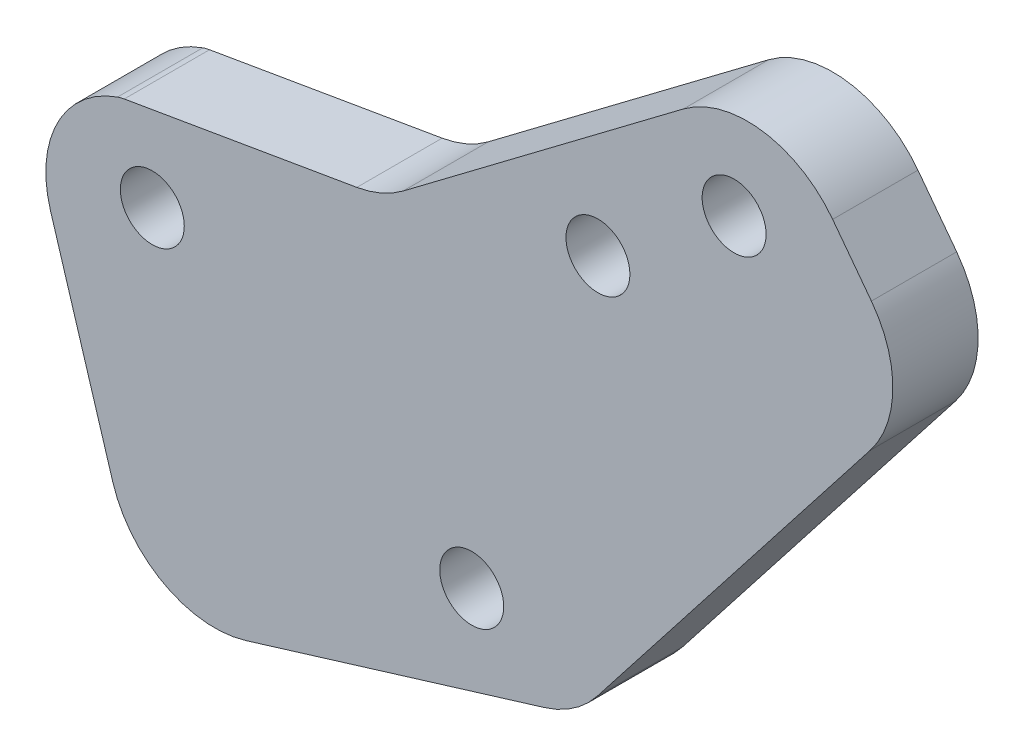
ISO-10303-21;
HEADER;
FILE_DESCRIPTION(('STEP AP214'),'2;1');
FILE_NAME('part.step','',(''),(''),'','','');
FILE_SCHEMA(('AUTOMOTIVE_DESIGN { 1 0 10303 214 1 1 1 1 }'));
ENDSEC;
DATA;
#1=APPLICATION_CONTEXT('core data for automotive mechanical design processes');
#2=APPLICATION_PROTOCOL_DEFINITION('international standard','automotive_design',2000,#1);
#3=PRODUCT_CONTEXT('',#1,'mechanical');
#4=PRODUCT('Part','Part','',(#3));
#5=PRODUCT_RELATED_PRODUCT_CATEGORY('part','',(#4));
#6=PRODUCT_DEFINITION_FORMATION('','',#4);
#7=PRODUCT_DEFINITION_CONTEXT('part definition',#1,'design');
#8=PRODUCT_DEFINITION('design','',#6,#7);
#9=PRODUCT_DEFINITION_SHAPE('','',#8);
#10=(LENGTH_UNIT() NAMED_UNIT(*) SI_UNIT(.MILLI.,.METRE.));
#11=(NAMED_UNIT(*) PLANE_ANGLE_UNIT() SI_UNIT($,.RADIAN.));
#12=(NAMED_UNIT(*) SI_UNIT($,.STERADIAN.) SOLID_ANGLE_UNIT());
#13=UNCERTAINTY_MEASURE_WITH_UNIT(LENGTH_MEASURE(1.E-05),#10,'distance_accuracy_value','');
#14=(GEOMETRIC_REPRESENTATION_CONTEXT(3) GLOBAL_UNCERTAINTY_ASSIGNED_CONTEXT((#13)) GLOBAL_UNIT_ASSIGNED_CONTEXT((#10,
#11,#12)) REPRESENTATION_CONTEXT('',''));
#15=CARTESIAN_POINT('',(0.,0.,0.));
#16=DIRECTION('',(0.,0.,1.));
#17=DIRECTION('',(1.,0.,0.));
#18=AXIS2_PLACEMENT_3D('',#15,#16,#17);
#19=CARTESIAN_POINT('',(-13.3090812894519,-11.9425105504531,4.));
#20=DIRECTION('',(0.,0.,1.));
#21=DIRECTION('',(1.,0.,0.));
#22=AXIS2_PLACEMENT_3D('',#19,#20,#21);
#23=PLANE('',#22);
#24=DIRECTION('',(-0.985725884798114,-0.168358189699742,0.));
#25=VECTOR('',#24,1.);
#26=CARTESIAN_POINT('',(-5.44500347129782,4.49425447166441,4.));
#27=LINE('',#26,#25);
#28=CARTESIAN_POINT('',(-6.64226547749985,4.2897667260659,4.));
#29=VERTEX_POINT('',#28);
#30=CARTESIAN_POINT('',(-17.5526898775014,2.42630820360216,4.));
#31=VERTEX_POINT('',#30);
#32=EDGE_CURVE('E222',#29,#31,#27,.T.);
#33=ORIENTED_EDGE('',*,*,#32,.T.);
#34=CARTESIAN_POINT('',(-17.2159734981019,0.454856434005934,4.));
#35=DIRECTION('',(0.,0.,1.));
#36=DIRECTION('',(1.,0.,0.));
#37=AXIS2_PLACEMENT_3D('',#34,#35,#36);
#38=CIRCLE('',#37,2.);
#39=CARTESIAN_POINT('',(-17.8714236057181,2.34440271722472,4.));
#40=VERTEX_POINT('',#39);
#41=EDGE_CURVE('E11',#31,#40,#38,.T.);
#42=ORIENTED_EDGE('',*,*,#41,.T.);
#43=CARTESIAN_POINT('',(-16.2327983366776,-2.37946299082225,4.));
#44=DIRECTION('',(0.,0.,1.));
#45=DIRECTION('',(1.,0.,0.));
#46=AXIS2_PLACEMENT_3D('',#43,#44,#45);
#47=CIRCLE('',#46,5.);
#48=CARTESIAN_POINT('',(-21.0143221164931,-3.84132151443514,4.));
#49=VERTEX_POINT('',#48);
#50=EDGE_CURVE('E209',#40,#49,#47,.T.);
#51=ORIENTED_EDGE('',*,*,#50,.T.);
#52=DIRECTION('',(0.292371704722578,-0.956304755963084,0.));
#53=VECTOR('',#52,1.);
#54=CARTESIAN_POINT('',(-21.0143221164931,-3.84132151443514,4.));
#55=LINE('',#54,#53);
#56=CARTESIAN_POINT('',(-18.0906050692673,-13.404369074066,4.));
#57=VERTEX_POINT('',#56);
#58=EDGE_CURVE('E147',#49,#57,#55,.T.);
#59=ORIENTED_EDGE('',*,*,#58,.T.);
#60=CARTESIAN_POINT('',(-13.3090812894519,-11.9425105504531,4.));
#61=DIRECTION('',(0.,0.,1.));
#62=DIRECTION('',(1.,0.,0.));
#63=AXIS2_PLACEMENT_3D('',#60,#61,#62);
#64=CIRCLE('',#63,5.);
#65=CARTESIAN_POINT('',(-11.847222765839,-16.7240343302685,4.));
#66=VERTEX_POINT('',#65);
#67=EDGE_CURVE('E142',#57,#66,#64,.T.);
#68=ORIENTED_EDGE('',*,*,#67,.T.);
#69=DIRECTION('',(0.956304755963084,0.292371704722577,0.));
#70=VECTOR('',#69,1.);
#71=CARTESIAN_POINT('',(-11.847222765839,-16.7240343302685,4.));
#72=LINE('',#71,#70);
#73=CARTESIAN_POINT('',(2.15671770663999,-12.4426000665136,4.));
#74=VERTEX_POINT('',#73);
#75=EDGE_CURVE('E130',#66,#74,#72,.T.);
#76=ORIENTED_EDGE('',*,*,#75,.T.);
#77=CARTESIAN_POINT('',(0.694859183027105,-7.66107628669814,4.));
#78=DIRECTION('',(0.,0.,1.));
#79=DIRECTION('',(1.,0.,0.));
#80=AXIS2_PLACEMENT_3D('',#77,#78,#79);
#81=CIRCLE('',#80,5.);
#82=CARTESIAN_POINT('',(4.6349129510602,-10.7393836633271,4.));
#83=VERTEX_POINT('',#82);
#84=EDGE_CURVE('E195',#74,#83,#81,.T.);
#85=ORIENTED_EDGE('',*,*,#84,.T.);
#86=DIRECTION('',(0.615661475325789,0.78801075360662,0.));
#87=VECTOR('',#86,1.);
#88=CARTESIAN_POINT('',(19.8025777587109,8.67434198712827,4.));
#89=LINE('',#88,#87);
#90=CARTESIAN_POINT('',(17.4405094313288,5.65103239682827,4.));
#91=VERTEX_POINT('',#90);
#92=EDGE_CURVE('E269',#83,#91,#89,.T.);
#93=ORIENTED_EDGE('',*,*,#92,.T.);
#94=CARTESIAN_POINT('',(13.5004556632957,8.72933977345722,4.));
#95=DIRECTION('',(0.,0.,1.));
#96=DIRECTION('',(1.,0.,0.));
#97=AXIS2_PLACEMENT_3D('',#94,#95,#96);
#98=CIRCLE('',#97,5.);
#99=CARTESIAN_POINT('',(17.4936332135327,11.7384148892168,4.));
#100=VERTEX_POINT('',#99);
#101=EDGE_CURVE('E197',#91,#100,#98,.T.);
#102=ORIENTED_EDGE('',*,*,#101,.T.);
#103=DIRECTION('',(-0.601815023151916,0.798635510047392,0.));
#104=VECTOR('',#103,1.);
#105=CARTESIAN_POINT('',(12.6674544163603,18.1429704702208,4.));
#106=LINE('',#105,#104);
#107=CARTESIAN_POINT('',(15.6765295321199,14.1497929199838,4.));
#108=VERTEX_POINT('',#107);
#109=EDGE_CURVE('E141',#100,#108,#106,.T.);
#110=ORIENTED_EDGE('',*,*,#109,.T.);
#111=CARTESIAN_POINT('',(11.6833519818829,11.1407178042243,4.));
#112=DIRECTION('',(0.,0.,1.));
#113=DIRECTION('',(1.,0.,0.));
#114=AXIS2_PLACEMENT_3D('',#111,#112,#113);
#115=CIRCLE('',#114,5.);
#116=CARTESIAN_POINT('',(8.67427686612335,15.1338953544612,4.));
#117=VERTEX_POINT('',#116);
#118=EDGE_CURVE('E174',#108,#117,#115,.T.);
#119=ORIENTED_EDGE('',*,*,#118,.T.);
#120=DIRECTION('',(-0.798635510047392,-0.601815023151916,0.));
#121=VECTOR('',#120,1.);
#122=CARTESIAN_POINT('',(12.6674544163603,18.1429704702208,4.));
#123=LINE('',#122,#121);
#124=CARTESIAN_POINT('',(-4.47498131023898,5.22521859981951,4.));
#125=VERTEX_POINT('',#124);
#126=EDGE_CURVE('E243',#117,#125,#123,.T.);
#127=ORIENTED_EDGE('',*,*,#126,.T.);
#128=CARTESIAN_POINT('',(-7.48405642599856,9.21839615005648,4.));
#129=DIRECTION('',(0.,0.,1.));
#130=DIRECTION('',(1.,0.,0.));
#131=AXIS2_PLACEMENT_3D('',#128,#129,#130);
#132=CIRCLE('',#131,5.);
#133=EDGE_CURVE('E181',#125,#29,#132,.F.);
#134=ORIENTED_EDGE('',*,*,#133,.T.);
#135=EDGE_LOOP('',(#33,#42,#51,#59,#68,#76,#85,#93,#102,#110,#119,#127,#134));
#136=FACE_BOUND('',#135,.T.);
#137=CARTESIAN_POINT('',(-16.2382786146113,-1.33544672344239,4.));
#138=DIRECTION('',(0.,0.,1.));
#139=DIRECTION('',(1.,0.,0.));
#140=AXIS2_PLACEMENT_3D('',#137,#138,#139);
#141=CIRCLE('',#140,1.5);
#142=CARTESIAN_POINT('',(-14.7382786146113,-1.33544672344239,4.));
#143=VERTEX_POINT('',#142);
#144=EDGE_CURVE('E257',#143,#143,#141,.T.);
#145=ORIENTED_EDGE('',*,*,#144,.F.);
#146=EDGE_LOOP('',(#145));
#147=FACE_BOUND('',#146,.T.);
#148=CARTESIAN_POINT('',(11.0540255403552,11.9758621995627,4.));
#149=DIRECTION('',(0.,0.,1.));
#150=DIRECTION('',(1.,0.,0.));
#151=AXIS2_PLACEMENT_3D('',#148,#149,#150);
#152=CIRCLE('',#151,1.5);
#153=CARTESIAN_POINT('',(12.5540255403552,11.9758621995627,4.));
#154=VERTEX_POINT('',#153);
#155=EDGE_CURVE('E228',#154,#154,#152,.T.);
#156=ORIENTED_EDGE('',*,*,#155,.F.);
#157=EDGE_LOOP('',(#156));
#158=FACE_BOUND('',#157,.T.);
#159=CARTESIAN_POINT('',(4.6649414599761,7.16134201434734,4.));
#160=DIRECTION('',(0.,0.,1.));
#161=DIRECTION('',(1.,0.,0.));
#162=AXIS2_PLACEMENT_3D('',#159,#160,#161);
#163=CIRCLE('',#162,1.5);
#164=CARTESIAN_POINT('',(6.16494145997611,7.16134201434734,4.));
#165=VERTEX_POINT('',#164);
#166=EDGE_CURVE('E251',#165,#165,#163,.T.);
#167=ORIENTED_EDGE('',*,*,#166,.F.);
#168=EDGE_LOOP('',(#167));
#169=FACE_BOUND('',#168,.T.);
#170=CARTESIAN_POINT('',(-1.25416108638335,-9.30264333832848,4.));
#171=DIRECTION('',(0.,0.,1.));
#172=DIRECTION('',(1.,0.,0.));
#173=AXIS2_PLACEMENT_3D('',#170,#171,#172);
#174=CIRCLE('',#173,1.50000000000001);
#175=CARTESIAN_POINT('',(0.245838913616663,-9.30264333832848,4.));
#176=VERTEX_POINT('',#175);
#177=EDGE_CURVE('E263',#176,#176,#174,.T.);
#178=ORIENTED_EDGE('',*,*,#177,.F.);
#179=EDGE_LOOP('',(#178));
#180=FACE_BOUND('',#179,.T.);
#181=ADVANCED_FACE('F35',(#136,#147,#158,#169,#180),#23,.T.);
#182=CARTESIAN_POINT('',(-13.3090812894519,-11.9425105504531,0.));
#183=DIRECTION('',(0.,0.,1.));
#184=DIRECTION('',(1.,0.,0.));
#185=AXIS2_PLACEMENT_3D('',#182,#183,#184);
#186=PLANE('',#185);
#187=CARTESIAN_POINT('',(-16.2327983366776,-2.37946299082225,0.));
#188=DIRECTION('',(0.,0.,1.));
#189=DIRECTION('',(1.,0.,0.));
#190=AXIS2_PLACEMENT_3D('',#187,#188,#189);
#191=CIRCLE('',#190,5.);
#192=CARTESIAN_POINT('',(-17.8714236057181,2.34440271722472,0.));
#193=VERTEX_POINT('',#192);
#194=CARTESIAN_POINT('',(-21.0143221164931,-3.84132151443514,0.));
#195=VERTEX_POINT('',#194);
#196=EDGE_CURVE('E208',#193,#195,#191,.T.);
#197=ORIENTED_EDGE('',*,*,#196,.F.);
#198=CARTESIAN_POINT('',(-17.2159734981019,0.454856434005934,0.));
#199=DIRECTION('',(0.,0.,1.));
#200=DIRECTION('',(1.,0.,0.));
#201=AXIS2_PLACEMENT_3D('',#198,#199,#200);
#202=CIRCLE('',#201,2.);
#203=CARTESIAN_POINT('',(-17.5526898775014,2.42630820360216,0.));
#204=VERTEX_POINT('',#203);
#205=EDGE_CURVE('E57',#193,#204,#202,.F.);
#206=ORIENTED_EDGE('',*,*,#205,.T.);
#207=DIRECTION('',(-0.985725884798114,-0.168358189699742,0.));
#208=VECTOR('',#207,1.);
#209=CARTESIAN_POINT('',(-5.44500347129782,4.49425447166441,0.));
#210=LINE('',#209,#208);
#211=CARTESIAN_POINT('',(-6.64226547749985,4.2897667260659,0.));
#212=VERTEX_POINT('',#211);
#213=EDGE_CURVE('E215',#212,#204,#210,.T.);
#214=ORIENTED_EDGE('',*,*,#213,.F.);
#215=CARTESIAN_POINT('',(-7.48405642599856,9.21839615005648,0.));
#216=DIRECTION('',(0.,0.,1.));
#217=DIRECTION('',(1.,0.,0.));
#218=AXIS2_PLACEMENT_3D('',#215,#216,#217);
#219=CIRCLE('',#218,5.);
#220=CARTESIAN_POINT('',(-4.47498131023898,5.22521859981951,0.));
#221=VERTEX_POINT('',#220);
#222=EDGE_CURVE('E179',#212,#221,#219,.T.);
#223=ORIENTED_EDGE('',*,*,#222,.T.);
#224=DIRECTION('',(-0.798635510047392,-0.601815023151916,0.));
#225=VECTOR('',#224,1.);
#226=CARTESIAN_POINT('',(12.6674544163603,18.1429704702208,0.));
#227=LINE('',#226,#225);
#228=CARTESIAN_POINT('',(8.67427686612335,15.1338953544612,0.));
#229=VERTEX_POINT('',#228);
#230=EDGE_CURVE('E218',#229,#221,#227,.T.);
#231=ORIENTED_EDGE('',*,*,#230,.F.);
#232=CARTESIAN_POINT('',(11.6833519818829,11.1407178042243,0.));
#233=DIRECTION('',(0.,0.,1.));
#234=DIRECTION('',(1.,0.,0.));
#235=AXIS2_PLACEMENT_3D('',#232,#233,#234);
#236=CIRCLE('',#235,5.);
#237=CARTESIAN_POINT('',(15.6765295321199,14.1497929199838,0.));
#238=VERTEX_POINT('',#237);
#239=EDGE_CURVE('E168',#229,#238,#236,.F.);
#240=ORIENTED_EDGE('',*,*,#239,.T.);
#241=DIRECTION('',(-0.601815023151916,0.798635510047392,0.));
#242=VECTOR('',#241,1.);
#243=CARTESIAN_POINT('',(12.6674544163603,18.1429704702208,0.));
#244=LINE('',#243,#242);
#245=CARTESIAN_POINT('',(17.4936332135327,11.7384148892168,0.));
#246=VERTEX_POINT('',#245);
#247=EDGE_CURVE('E230',#246,#238,#244,.T.);
#248=ORIENTED_EDGE('',*,*,#247,.F.);
#249=CARTESIAN_POINT('',(13.5004556632957,8.72933977345722,0.));
#250=DIRECTION('',(0.,0.,1.));
#251=DIRECTION('',(1.,0.,0.));
#252=AXIS2_PLACEMENT_3D('',#249,#250,#251);
#253=CIRCLE('',#252,5.);
#254=CARTESIAN_POINT('',(17.4405094313288,5.65103239682827,0.));
#255=VERTEX_POINT('',#254);
#256=EDGE_CURVE('E188',#246,#255,#253,.F.);
#257=ORIENTED_EDGE('',*,*,#256,.T.);
#258=DIRECTION('',(0.615661475325789,0.78801075360662,0.));
#259=VECTOR('',#258,1.);
#260=CARTESIAN_POINT('',(19.8025777587109,8.67434198712827,0.));
#261=LINE('',#260,#259);
#262=CARTESIAN_POINT('',(4.6349129510602,-10.7393836633271,0.));
#263=VERTEX_POINT('',#262);
#264=EDGE_CURVE('E272',#263,#255,#261,.T.);
#265=ORIENTED_EDGE('',*,*,#264,.F.);
#266=CARTESIAN_POINT('',(0.694859183027105,-7.66107628669814,0.));
#267=DIRECTION('',(0.,0.,1.));
#268=DIRECTION('',(1.,0.,0.));
#269=AXIS2_PLACEMENT_3D('',#266,#267,#268);
#270=CIRCLE('',#269,5.);
#271=CARTESIAN_POINT('',(2.15671770663999,-12.4426000665136,0.));
#272=VERTEX_POINT('',#271);
#273=EDGE_CURVE('E186',#263,#272,#270,.F.);
#274=ORIENTED_EDGE('',*,*,#273,.T.);
#275=DIRECTION('',(0.956304755963084,0.292371704722577,0.));
#276=VECTOR('',#275,1.);
#277=CARTESIAN_POINT('',(-11.847222765839,-16.7240343302685,0.));
#278=LINE('',#277,#276);
#279=CARTESIAN_POINT('',(-11.847222765839,-16.7240343302685,0.));
#280=VERTEX_POINT('',#279);
#281=EDGE_CURVE('E227',#280,#272,#278,.T.);
#282=ORIENTED_EDGE('',*,*,#281,.F.);
#283=CARTESIAN_POINT('',(-13.3090812894519,-11.9425105504531,0.));
#284=DIRECTION('',(0.,0.,1.));
#285=DIRECTION('',(1.,0.,0.));
#286=AXIS2_PLACEMENT_3D('',#283,#284,#285);
#287=CIRCLE('',#286,5.);
#288=CARTESIAN_POINT('',(-18.0906050692673,-13.404369074066,0.));
#289=VERTEX_POINT('',#288);
#290=EDGE_CURVE('E155',#289,#280,#287,.T.);
#291=ORIENTED_EDGE('',*,*,#290,.F.);
#292=DIRECTION('',(0.292371704722578,-0.956304755963084,0.));
#293=VECTOR('',#292,1.);
#294=CARTESIAN_POINT('',(-21.0143221164931,-3.84132151443514,0.));
#295=LINE('',#294,#293);
#296=EDGE_CURVE('E151',#195,#289,#295,.T.);
#297=ORIENTED_EDGE('',*,*,#296,.F.);
#298=EDGE_LOOP('',(#197,#206,#214,#223,#231,#240,#248,#257,#265,#274,#282,#291,#297));
#299=FACE_BOUND('',#298,.T.);
#300=CARTESIAN_POINT('',(11.0540255403552,11.9758621995627,0.));
#301=DIRECTION('',(0.,0.,1.));
#302=DIRECTION('',(1.,0.,0.));
#303=AXIS2_PLACEMENT_3D('',#300,#301,#302);
#304=CIRCLE('',#303,1.5);
#305=CARTESIAN_POINT('',(12.5540255403552,11.9758621995627,0.));
#306=VERTEX_POINT('',#305);
#307=EDGE_CURVE('E248',#306,#306,#304,.T.);
#308=ORIENTED_EDGE('',*,*,#307,.T.);
#309=EDGE_LOOP('',(#308));
#310=FACE_BOUND('',#309,.T.);
#311=CARTESIAN_POINT('',(4.6649414599761,7.16134201434734,0.));
#312=DIRECTION('',(0.,0.,1.));
#313=DIRECTION('',(1.,0.,0.));
#314=AXIS2_PLACEMENT_3D('',#311,#312,#313);
#315=CIRCLE('',#314,1.5);
#316=CARTESIAN_POINT('',(6.16494145997611,7.16134201434734,0.));
#317=VERTEX_POINT('',#316);
#318=EDGE_CURVE('E254',#317,#317,#315,.T.);
#319=ORIENTED_EDGE('',*,*,#318,.T.);
#320=EDGE_LOOP('',(#319));
#321=FACE_BOUND('',#320,.T.);
#322=CARTESIAN_POINT('',(-16.2382786146113,-1.33544672344239,0.));
#323=DIRECTION('',(0.,0.,1.));
#324=DIRECTION('',(1.,0.,0.));
#325=AXIS2_PLACEMENT_3D('',#322,#323,#324);
#326=CIRCLE('',#325,1.5);
#327=CARTESIAN_POINT('',(-14.7382786146113,-1.33544672344239,0.));
#328=VERTEX_POINT('',#327);
#329=EDGE_CURVE('E260',#328,#328,#326,.T.);
#330=ORIENTED_EDGE('',*,*,#329,.T.);
#331=EDGE_LOOP('',(#330));
#332=FACE_BOUND('',#331,.T.);
#333=CARTESIAN_POINT('',(-1.25416108638335,-9.30264333832848,0.));
#334=DIRECTION('',(0.,0.,1.));
#335=DIRECTION('',(1.,0.,0.));
#336=AXIS2_PLACEMENT_3D('',#333,#334,#335);
#337=CIRCLE('',#336,1.50000000000001);
#338=CARTESIAN_POINT('',(0.245838913616663,-9.30264333832848,0.));
#339=VERTEX_POINT('',#338);
#340=EDGE_CURVE('E266',#339,#339,#337,.T.);
#341=ORIENTED_EDGE('',*,*,#340,.T.);
#342=EDGE_LOOP('',(#341));
#343=FACE_BOUND('',#342,.T.);
#344=ADVANCED_FACE('F213',(#299,#310,#321,#332,#343),#186,.F.);
#345=CARTESIAN_POINT('',(-13.3090812894519,-11.9425105504531,4.));
#346=DIRECTION('',(0.,0.,-1.));
#347=DIRECTION('',(-1.,0.,0.));
#348=AXIS2_PLACEMENT_3D('',#345,#346,#347);
#349=CYLINDRICAL_SURFACE('',#348,5.);
#350=ORIENTED_EDGE('',*,*,#290,.T.);
#351=DIRECTION('',(0.,0.,-1.));
#352=VECTOR('',#351,1.);
#353=CARTESIAN_POINT('',(-11.847222765839,-16.7240343302685,4.));
#354=LINE('',#353,#352);
#355=EDGE_CURVE('E135',#66,#280,#354,.T.);
#356=ORIENTED_EDGE('',*,*,#355,.F.);
#357=ORIENTED_EDGE('',*,*,#67,.F.);
#358=DIRECTION('',(0.,0.,-1.));
#359=VECTOR('',#358,1.);
#360=CARTESIAN_POINT('',(-18.0906050692673,-13.404369074066,4.));
#361=LINE('',#360,#359);
#362=EDGE_CURVE('E162',#57,#289,#361,.T.);
#363=ORIENTED_EDGE('',*,*,#362,.T.);
#364=EDGE_LOOP('',(#350,#356,#357,#363));
#365=FACE_BOUND('',#364,.T.);
#366=ADVANCED_FACE('F153',(#365),#349,.T.);
#367=CARTESIAN_POINT('',(-11.847222765839,-16.7240343302685,4.));
#368=DIRECTION('',(-0.292371704722577,0.956304755963084,0.));
#369=DIRECTION('',(-0.956304755963084,-0.292371704722577,0.));
#370=AXIS2_PLACEMENT_3D('',#367,#368,#369);
#371=PLANE('',#370);
#372=ORIENTED_EDGE('',*,*,#281,.T.);
#373=DIRECTION('',(0.,0.,-1.));
#374=VECTOR('',#373,1.);
#375=CARTESIAN_POINT('',(2.15671770663999,-12.4426000665136,4.));
#376=LINE('',#375,#374);
#377=EDGE_CURVE('E138',#272,#74,#376,.F.);
#378=ORIENTED_EDGE('',*,*,#377,.T.);
#379=ORIENTED_EDGE('',*,*,#75,.F.);
#380=ORIENTED_EDGE('',*,*,#355,.T.);
#381=EDGE_LOOP('',(#372,#378,#379,#380));
#382=FACE_BOUND('',#381,.T.);
#383=ADVANCED_FACE('F133',(#382),#371,.F.);
#384=CARTESIAN_POINT('',(12.6674544163603,18.1429704702208,4.));
#385=DIRECTION('',(-0.798635510047392,-0.601815023151916,0.));
#386=DIRECTION('',(0.601815023151916,-0.798635510047392,0.));
#387=AXIS2_PLACEMENT_3D('',#384,#385,#386);
#388=PLANE('',#387);
#389=ORIENTED_EDGE('',*,*,#109,.F.);
#390=DIRECTION('',(0.,0.,-1.));
#391=VECTOR('',#390,1.);
#392=CARTESIAN_POINT('',(17.4936332135327,11.7384148892168,4.));
#393=LINE('',#392,#391);
#394=EDGE_CURVE('E183',#100,#246,#393,.T.);
#395=ORIENTED_EDGE('',*,*,#394,.T.);
#396=ORIENTED_EDGE('',*,*,#247,.T.);
#397=DIRECTION('',(0.,0.,-1.));
#398=VECTOR('',#397,1.);
#399=CARTESIAN_POINT('',(15.6765295321199,14.1497929199838,4.));
#400=LINE('',#399,#398);
#401=EDGE_CURVE('E171',#238,#108,#400,.F.);
#402=ORIENTED_EDGE('',*,*,#401,.T.);
#403=EDGE_LOOP('',(#389,#395,#396,#402));
#404=FACE_BOUND('',#403,.T.);
#405=ADVANCED_FACE('F287',(#404),#388,.F.);
#406=CARTESIAN_POINT('',(12.6674544163603,18.1429704702208,4.));
#407=DIRECTION('',(0.601815023151916,-0.798635510047392,0.));
#408=DIRECTION('',(0.798635510047392,0.601815023151916,0.));
#409=AXIS2_PLACEMENT_3D('',#406,#407,#408);
#410=PLANE('',#409);
#411=ORIENTED_EDGE('',*,*,#126,.F.);
#412=DIRECTION('',(0.,0.,-1.));
#413=VECTOR('',#412,1.);
#414=CARTESIAN_POINT('',(8.67427686612336,15.1338953544612,4.));
#415=LINE('',#414,#413);
#416=EDGE_CURVE('E159',#117,#229,#415,.T.);
#417=ORIENTED_EDGE('',*,*,#416,.T.);
#418=ORIENTED_EDGE('',*,*,#230,.T.);
#419=DIRECTION('',(0.,0.,-1.));
#420=VECTOR('',#419,1.);
#421=CARTESIAN_POINT('',(-4.47498131023898,5.22521859981952,4.));
#422=LINE('',#421,#420);
#423=EDGE_CURVE('E156',#221,#125,#422,.F.);
#424=ORIENTED_EDGE('',*,*,#423,.T.);
#425=EDGE_LOOP('',(#411,#417,#418,#424));
#426=FACE_BOUND('',#425,.T.);
#427=ADVANCED_FACE('F236',(#426),#410,.F.);
#428=CARTESIAN_POINT('',(-5.44500347129782,4.49425447166441,4.));
#429=DIRECTION('',(0.168358189699742,-0.985725884798115,0.));
#430=DIRECTION('',(0.985725884798115,0.168358189699742,0.));
#431=AXIS2_PLACEMENT_3D('',#428,#429,#430);
#432=PLANE('',#431);
#433=ORIENTED_EDGE('',*,*,#213,.T.);
#434=DIRECTION('',(0.,0.,-1.));
#435=VECTOR('',#434,1.);
#436=CARTESIAN_POINT('',(-17.5526898775014,2.42630820360216,4.));
#437=LINE('',#436,#435);
#438=EDGE_CURVE('E43',#204,#31,#437,.F.);
#439=ORIENTED_EDGE('',*,*,#438,.T.);
#440=ORIENTED_EDGE('',*,*,#32,.F.);
#441=DIRECTION('',(0.,0.,-1.));
#442=VECTOR('',#441,1.);
#443=CARTESIAN_POINT('',(-6.64226547749985,4.2897667260659,0.));
#444=LINE('',#443,#442);
#445=EDGE_CURVE('E176',#29,#212,#444,.T.);
#446=ORIENTED_EDGE('',*,*,#445,.T.);
#447=EDGE_LOOP('',(#433,#439,#440,#446));
#448=FACE_BOUND('',#447,.T.);
#449=ADVANCED_FACE('F244',(#448),#432,.F.);
#450=CARTESIAN_POINT('',(-16.2327983366776,-2.37946299082225,4.));
#451=DIRECTION('',(0.,0.,-1.));
#452=DIRECTION('',(-1.,0.,0.));
#453=AXIS2_PLACEMENT_3D('',#450,#451,#452);
#454=CYLINDRICAL_SURFACE('',#453,5.);
#455=ORIENTED_EDGE('',*,*,#50,.F.);
#456=DIRECTION('',(0.,0.,-1.));
#457=VECTOR('',#456,1.);
#458=CARTESIAN_POINT('',(-17.8714236057181,2.34440271722472,4.));
#459=LINE('',#458,#457);
#460=EDGE_CURVE('E200',#40,#193,#459,.T.);
#461=ORIENTED_EDGE('',*,*,#460,.T.);
#462=ORIENTED_EDGE('',*,*,#196,.T.);
#463=DIRECTION('',(0.,0.,-1.));
#464=VECTOR('',#463,1.);
#465=CARTESIAN_POINT('',(-21.0143221164931,-3.84132151443514,4.));
#466=LINE('',#465,#464);
#467=EDGE_CURVE('E157',#49,#195,#466,.T.);
#468=ORIENTED_EDGE('',*,*,#467,.F.);
#469=EDGE_LOOP('',(#455,#461,#462,#468));
#470=FACE_BOUND('',#469,.T.);
#471=ADVANCED_FACE('F206',(#470),#454,.T.);
#472=CARTESIAN_POINT('',(-21.0143221164931,-3.84132151443514,4.));
#473=DIRECTION('',(0.956304755963084,0.292371704722578,0.));
#474=DIRECTION('',(-0.292371704722578,0.956304755963084,0.));
#475=AXIS2_PLACEMENT_3D('',#472,#473,#474);
#476=PLANE('',#475);
#477=ORIENTED_EDGE('',*,*,#296,.T.);
#478=ORIENTED_EDGE('',*,*,#362,.F.);
#479=ORIENTED_EDGE('',*,*,#58,.F.);
#480=ORIENTED_EDGE('',*,*,#467,.T.);
#481=EDGE_LOOP('',(#477,#478,#479,#480));
#482=FACE_BOUND('',#481,.T.);
#483=ADVANCED_FACE('F316',(#482),#476,.F.);
#484=CARTESIAN_POINT('',(11.0540255403552,11.9758621995627,4.));
#485=DIRECTION('',(0.,0.,-1.));
#486=DIRECTION('',(-1.,0.,0.));
#487=AXIS2_PLACEMENT_3D('',#484,#485,#486);
#488=CYLINDRICAL_SURFACE('',#487,1.5);
#489=ORIENTED_EDGE('',*,*,#155,.T.);
#490=EDGE_LOOP('',(#489));
#491=FACE_BOUND('',#490,.T.);
#492=ORIENTED_EDGE('',*,*,#307,.F.);
#493=EDGE_LOOP('',(#492));
#494=FACE_BOUND('',#493,.T.);
#495=ADVANCED_FACE('F313',(#491,#494),#488,.F.);
#496=CARTESIAN_POINT('',(4.6649414599761,7.16134201434734,4.));
#497=DIRECTION('',(0.,0.,-1.));
#498=DIRECTION('',(-1.,0.,0.));
#499=AXIS2_PLACEMENT_3D('',#496,#497,#498);
#500=CYLINDRICAL_SURFACE('',#499,1.5);
#501=ORIENTED_EDGE('',*,*,#166,.T.);
#502=EDGE_LOOP('',(#501));
#503=FACE_BOUND('',#502,.T.);
#504=ORIENTED_EDGE('',*,*,#318,.F.);
#505=EDGE_LOOP('',(#504));
#506=FACE_BOUND('',#505,.T.);
#507=ADVANCED_FACE('F368',(#503,#506),#500,.F.);
#508=CARTESIAN_POINT('',(-16.2382786146113,-1.33544672344239,4.));
#509=DIRECTION('',(0.,0.,-1.));
#510=DIRECTION('',(-1.,0.,0.));
#511=AXIS2_PLACEMENT_3D('',#508,#509,#510);
#512=CYLINDRICAL_SURFACE('',#511,1.5);
#513=ORIENTED_EDGE('',*,*,#144,.T.);
#514=EDGE_LOOP('',(#513));
#515=FACE_BOUND('',#514,.T.);
#516=ORIENTED_EDGE('',*,*,#329,.F.);
#517=EDGE_LOOP('',(#516));
#518=FACE_BOUND('',#517,.T.);
#519=ADVANCED_FACE('F302',(#515,#518),#512,.F.);
#520=CARTESIAN_POINT('',(-1.25416108638335,-9.30264333832848,4.));
#521=DIRECTION('',(0.,0.,-1.));
#522=DIRECTION('',(-1.,0.,0.));
#523=AXIS2_PLACEMENT_3D('',#520,#521,#522);
#524=CYLINDRICAL_SURFACE('',#523,1.50000000000001);
#525=ORIENTED_EDGE('',*,*,#177,.T.);
#526=EDGE_LOOP('',(#525));
#527=FACE_BOUND('',#526,.T.);
#528=ORIENTED_EDGE('',*,*,#340,.F.);
#529=EDGE_LOOP('',(#528));
#530=FACE_BOUND('',#529,.T.);
#531=ADVANCED_FACE('F294',(#527,#530),#524,.F.);
#532=CARTESIAN_POINT('',(11.6833519818829,11.1407178042243,4.));
#533=DIRECTION('',(0.,0.,-1.));
#534=DIRECTION('',(-1.,0.,0.));
#535=AXIS2_PLACEMENT_3D('',#532,#533,#534);
#536=CYLINDRICAL_SURFACE('',#535,5.);
#537=ORIENTED_EDGE('',*,*,#118,.F.);
#538=ORIENTED_EDGE('',*,*,#401,.F.);
#539=ORIENTED_EDGE('',*,*,#239,.F.);
#540=ORIENTED_EDGE('',*,*,#416,.F.);
#541=EDGE_LOOP('',(#537,#538,#539,#540));
#542=FACE_BOUND('',#541,.T.);
#543=ADVANCED_FACE('F292',(#542),#536,.T.);
#544=CARTESIAN_POINT('',(-7.48405642599856,9.21839615005648,4.));
#545=DIRECTION('',(0.,0.,1.));
#546=DIRECTION('',(1.,0.,0.));
#547=AXIS2_PLACEMENT_3D('',#544,#545,#546);
#548=CYLINDRICAL_SURFACE('',#547,5.);
#549=ORIENTED_EDGE('',*,*,#133,.F.);
#550=ORIENTED_EDGE('',*,*,#423,.F.);
#551=ORIENTED_EDGE('',*,*,#222,.F.);
#552=ORIENTED_EDGE('',*,*,#445,.F.);
#553=EDGE_LOOP('',(#549,#550,#551,#552));
#554=FACE_BOUND('',#553,.T.);
#555=ADVANCED_FACE('F241',(#554),#548,.F.);
#556=CARTESIAN_POINT('',(19.8025777587109,8.67434198712827,4.));
#557=DIRECTION('',(-0.78801075360662,0.615661475325789,0.));
#558=DIRECTION('',(-0.615661475325789,-0.78801075360662,0.));
#559=AXIS2_PLACEMENT_3D('',#556,#557,#558);
#560=PLANE('',#559);
#561=ORIENTED_EDGE('',*,*,#264,.T.);
#562=DIRECTION('',(0.,0.,-1.));
#563=VECTOR('',#562,1.);
#564=CARTESIAN_POINT('',(17.4405094313288,5.65103239682827,4.));
#565=LINE('',#564,#563);
#566=EDGE_CURVE('E193',#255,#91,#565,.F.);
#567=ORIENTED_EDGE('',*,*,#566,.T.);
#568=ORIENTED_EDGE('',*,*,#92,.F.);
#569=DIRECTION('',(0.,0.,-1.));
#570=VECTOR('',#569,1.);
#571=CARTESIAN_POINT('',(4.6349129510602,-10.7393836633271,4.));
#572=LINE('',#571,#570);
#573=EDGE_CURVE('E190',#83,#263,#572,.T.);
#574=ORIENTED_EDGE('',*,*,#573,.T.);
#575=EDGE_LOOP('',(#561,#567,#568,#574));
#576=FACE_BOUND('',#575,.T.);
#577=ADVANCED_FACE('F300',(#576),#560,.F.);
#578=CARTESIAN_POINT('',(13.5004556632957,8.72933977345722,4.));
#579=DIRECTION('',(0.,0.,-1.));
#580=DIRECTION('',(-1.,0.,0.));
#581=AXIS2_PLACEMENT_3D('',#578,#579,#580);
#582=CYLINDRICAL_SURFACE('',#581,5.);
#583=ORIENTED_EDGE('',*,*,#101,.F.);
#584=ORIENTED_EDGE('',*,*,#566,.F.);
#585=ORIENTED_EDGE('',*,*,#256,.F.);
#586=ORIENTED_EDGE('',*,*,#394,.F.);
#587=EDGE_LOOP('',(#583,#584,#585,#586));
#588=FACE_BOUND('',#587,.T.);
#589=ADVANCED_FACE('F284',(#588),#582,.T.);
#590=CARTESIAN_POINT('',(0.694859183027105,-7.66107628669814,4.));
#591=DIRECTION('',(0.,0.,-1.));
#592=DIRECTION('',(-1.,0.,0.));
#593=AXIS2_PLACEMENT_3D('',#590,#591,#592);
#594=CYLINDRICAL_SURFACE('',#593,5.);
#595=ORIENTED_EDGE('',*,*,#84,.F.);
#596=ORIENTED_EDGE('',*,*,#377,.F.);
#597=ORIENTED_EDGE('',*,*,#273,.F.);
#598=ORIENTED_EDGE('',*,*,#573,.F.);
#599=EDGE_LOOP('',(#595,#596,#597,#598));
#600=FACE_BOUND('',#599,.T.);
#601=ADVANCED_FACE('F411',(#600),#594,.T.);
#602=CARTESIAN_POINT('',(-17.2159734981019,0.454856434005934,4.));
#603=DIRECTION('',(0.,0.,-1.));
#604=DIRECTION('',(-1.,0.,0.));
#605=AXIS2_PLACEMENT_3D('',#602,#603,#604);
#606=CYLINDRICAL_SURFACE('',#605,2.);
#607=ORIENTED_EDGE('',*,*,#41,.F.);
#608=ORIENTED_EDGE('',*,*,#438,.F.);
#609=ORIENTED_EDGE('',*,*,#205,.F.);
#610=ORIENTED_EDGE('',*,*,#460,.F.);
#611=EDGE_LOOP('',(#607,#608,#609,#610));
#612=FACE_BOUND('',#611,.T.);
#613=ADVANCED_FACE('F37',(#612),#606,.T.);
#614=CLOSED_SHELL('',(#181,#344,#366,#383,#405,#427,#449,#471,#483,#495,#507,#519,#531,#543,
#555,#577,#589,#601,#613));
#615=MANIFOLD_SOLID_BREP('B2',#614);
#616=ADVANCED_BREP_SHAPE_REPRESENTATION('',(#18,#615),#14);
#617=SHAPE_DEFINITION_REPRESENTATION(#9,#616);
ENDSEC;
END-ISO-10303-21;
